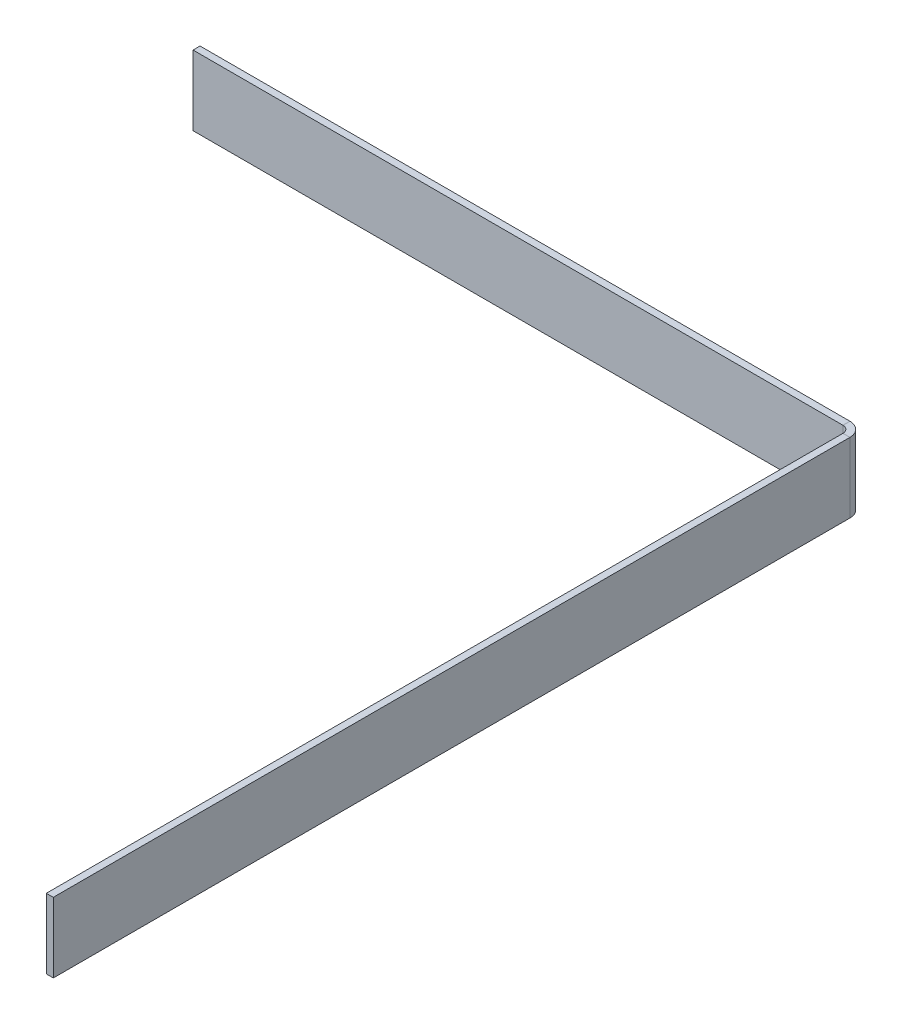
ISO-10303-21;
HEADER;
FILE_DESCRIPTION(('STEP AP214'),'2;1');
FILE_NAME('part.step','',(''),(''),'','','');
FILE_SCHEMA(('AUTOMOTIVE_DESIGN { 1 0 10303 214 1 1 1 1 }'));
ENDSEC;
DATA;
#1=APPLICATION_CONTEXT('core data for automotive mechanical design processes');
#2=APPLICATION_PROTOCOL_DEFINITION('international standard','automotive_design',2000,#1);
#3=PRODUCT_CONTEXT('',#1,'mechanical');
#4=PRODUCT('Part','Part','',(#3));
#5=PRODUCT_RELATED_PRODUCT_CATEGORY('part','',(#4));
#6=PRODUCT_DEFINITION_FORMATION('','',#4);
#7=PRODUCT_DEFINITION_CONTEXT('part definition',#1,'design');
#8=PRODUCT_DEFINITION('design','',#6,#7);
#9=PRODUCT_DEFINITION_SHAPE('','',#8);
#10=(LENGTH_UNIT() NAMED_UNIT(*) SI_UNIT(.MILLI.,.METRE.));
#11=(NAMED_UNIT(*) PLANE_ANGLE_UNIT() SI_UNIT($,.RADIAN.));
#12=(NAMED_UNIT(*) SI_UNIT($,.STERADIAN.) SOLID_ANGLE_UNIT());
#13=UNCERTAINTY_MEASURE_WITH_UNIT(LENGTH_MEASURE(1.E-05),#10,'distance_accuracy_value','');
#14=(GEOMETRIC_REPRESENTATION_CONTEXT(3) GLOBAL_UNCERTAINTY_ASSIGNED_CONTEXT((#13)) GLOBAL_UNIT_ASSIGNED_CONTEXT((#10,
#11,#12)) REPRESENTATION_CONTEXT('',''));
#15=CARTESIAN_POINT('',(0.,0.,0.));
#16=DIRECTION('',(0.,0.,1.));
#17=DIRECTION('',(1.,0.,0.));
#18=AXIS2_PLACEMENT_3D('',#15,#16,#17);
#19=CARTESIAN_POINT('',(0.,20.,2.));
#20=DIRECTION('',(0.,-1.,0.));
#21=DIRECTION('',(-1.,0.,0.));
#22=AXIS2_PLACEMENT_3D('',#19,#20,#21);
#23=PLANE('',#22);
#24=DIRECTION('',(-1.,0.,0.));
#25=VECTOR('',#24,1.);
#26=CARTESIAN_POINT('',(0.,20.,2.));
#27=LINE('',#26,#25);
#28=CARTESIAN_POINT('',(186.,20.,2.00000000000001));
#29=VERTEX_POINT('',#28);
#30=CARTESIAN_POINT('',(0.,20.,2.));
#31=VERTEX_POINT('',#30);
#32=EDGE_CURVE('E85',#29,#31,#27,.T.);
#33=ORIENTED_EDGE('',*,*,#32,.F.);
#34=DIRECTION('',(0.,0.,-1.));
#35=VECTOR('',#34,1.);
#36=CARTESIAN_POINT('',(186.,20.,2.00000000000001));
#37=LINE('',#36,#35);
#38=CARTESIAN_POINT('',(186.,20.,0.));
#39=VERTEX_POINT('',#38);
#40=EDGE_CURVE('E143',#29,#39,#37,.T.);
#41=ORIENTED_EDGE('',*,*,#40,.T.);
#42=DIRECTION('',(-1.,0.,0.));
#43=VECTOR('',#42,1.);
#44=CARTESIAN_POINT('',(0.,20.,0.));
#45=LINE('',#44,#43);
#46=CARTESIAN_POINT('',(0.,20.,0.));
#47=VERTEX_POINT('',#46);
#48=EDGE_CURVE('E186',#39,#47,#45,.T.);
#49=ORIENTED_EDGE('',*,*,#48,.T.);
#50=DIRECTION('',(0.,0.,1.));
#51=VECTOR('',#50,1.);
#52=CARTESIAN_POINT('',(0.,20.,2.));
#53=LINE('',#52,#51);
#54=EDGE_CURVE('E13',#47,#31,#53,.T.);
#55=ORIENTED_EDGE('',*,*,#54,.T.);
#56=EDGE_LOOP('',(#33,#41,#49,#55));
#57=FACE_BOUND('',#56,.T.);
#58=ADVANCED_FACE('F61',(#57),#23,.F.);
#59=CARTESIAN_POINT('',(0.,0.,2.));
#60=DIRECTION('',(0.,0.,-1.));
#61=DIRECTION('',(-1.,0.,0.));
#62=AXIS2_PLACEMENT_3D('',#59,#60,#61);
#63=PLANE('',#62);
#64=DIRECTION('',(0.,1.,0.));
#65=VECTOR('',#64,1.);
#66=CARTESIAN_POINT('',(186.,20.,2.00000000000001));
#67=LINE('',#66,#65);
#68=CARTESIAN_POINT('',(186.,0.,2.00000000000001));
#69=VERTEX_POINT('',#68);
#70=EDGE_CURVE('E144',#29,#69,#67,.F.);
#71=ORIENTED_EDGE('',*,*,#70,.F.);
#72=ORIENTED_EDGE('',*,*,#32,.T.);
#73=DIRECTION('',(0.,-1.,0.));
#74=VECTOR('',#73,1.);
#75=CARTESIAN_POINT('',(0.,0.,2.));
#76=LINE('',#75,#74);
#77=CARTESIAN_POINT('',(0.,0.,2.));
#78=VERTEX_POINT('',#77);
#79=EDGE_CURVE('E183',#31,#78,#76,.T.);
#80=ORIENTED_EDGE('',*,*,#79,.T.);
#81=DIRECTION('',(1.,0.,0.));
#82=VECTOR('',#81,1.);
#83=CARTESIAN_POINT('',(0.,0.,2.));
#84=LINE('',#83,#82);
#85=EDGE_CURVE('E185',#78,#69,#84,.T.);
#86=ORIENTED_EDGE('',*,*,#85,.T.);
#87=EDGE_LOOP('',(#71,#72,#80,#86));
#88=FACE_BOUND('',#87,.T.);
#89=ADVANCED_FACE('F205',(#88),#63,.F.);
#90=CARTESIAN_POINT('',(0.,0.,0.));
#91=DIRECTION('',(0.,0.,-1.));
#92=DIRECTION('',(-1.,0.,0.));
#93=AXIS2_PLACEMENT_3D('',#90,#91,#92);
#94=PLANE('',#93);
#95=ORIENTED_EDGE('',*,*,#48,.F.);
#96=DIRECTION('',(0.,1.,0.));
#97=VECTOR('',#96,1.);
#98=CARTESIAN_POINT('',(186.,20.,0.));
#99=LINE('',#98,#97);
#100=CARTESIAN_POINT('',(186.,0.,0.));
#101=VERTEX_POINT('',#100);
#102=EDGE_CURVE('E103',#39,#101,#99,.F.);
#103=ORIENTED_EDGE('',*,*,#102,.T.);
#104=DIRECTION('',(-1.,0.,0.));
#105=VECTOR('',#104,1.);
#106=CARTESIAN_POINT('',(0.,0.,0.));
#107=LINE('',#106,#105);
#108=CARTESIAN_POINT('',(0.,0.,0.));
#109=VERTEX_POINT('',#108);
#110=EDGE_CURVE('E192',#109,#101,#107,.F.);
#111=ORIENTED_EDGE('',*,*,#110,.F.);
#112=DIRECTION('',(0.,1.,0.));
#113=VECTOR('',#112,1.);
#114=CARTESIAN_POINT('',(0.,0.,0.));
#115=LINE('',#114,#113);
#116=EDGE_CURVE('E181',#47,#109,#115,.F.);
#117=ORIENTED_EDGE('',*,*,#116,.F.);
#118=EDGE_LOOP('',(#95,#103,#111,#117));
#119=FACE_BOUND('',#118,.T.);
#120=ADVANCED_FACE('F198',(#119),#94,.T.);
#121=CARTESIAN_POINT('',(0.,0.,2.));
#122=DIRECTION('',(1.,0.,0.));
#123=DIRECTION('',(0.,-1.,0.));
#124=AXIS2_PLACEMENT_3D('',#121,#122,#123);
#125=PLANE('',#124);
#126=ORIENTED_EDGE('',*,*,#54,.F.);
#127=ORIENTED_EDGE('',*,*,#116,.T.);
#128=DIRECTION('',(0.,0.,1.));
#129=VECTOR('',#128,1.);
#130=CARTESIAN_POINT('',(0.,0.,2.));
#131=LINE('',#130,#129);
#132=EDGE_CURVE('E65',#109,#78,#131,.T.);
#133=ORIENTED_EDGE('',*,*,#132,.T.);
#134=ORIENTED_EDGE('',*,*,#79,.F.);
#135=EDGE_LOOP('',(#126,#127,#133,#134));
#136=FACE_BOUND('',#135,.T.);
#137=ADVANCED_FACE('F201',(#136),#125,.F.);
#138=CARTESIAN_POINT('',(0.,0.,2.));
#139=DIRECTION('',(0.,1.,0.));
#140=DIRECTION('',(1.,0.,0.));
#141=AXIS2_PLACEMENT_3D('',#138,#139,#140);
#142=PLANE('',#141);
#143=DIRECTION('',(0.,0.,-1.));
#144=VECTOR('',#143,1.);
#145=CARTESIAN_POINT('',(186.,0.,2.00000000000001));
#146=LINE('',#145,#144);
#147=EDGE_CURVE('E179',#69,#101,#146,.T.);
#148=ORIENTED_EDGE('',*,*,#147,.F.);
#149=ORIENTED_EDGE('',*,*,#85,.F.);
#150=ORIENTED_EDGE('',*,*,#132,.F.);
#151=ORIENTED_EDGE('',*,*,#110,.T.);
#152=EDGE_LOOP('',(#148,#149,#150,#151));
#153=FACE_BOUND('',#152,.T.);
#154=ADVANCED_FACE('F63',(#153),#142,.F.);
#155=CARTESIAN_POINT('',(186.,0.,4.00000000000001));
#156=DIRECTION('',(0.,-1.,0.));
#157=DIRECTION('',(0.,0.,-1.));
#158=AXIS2_PLACEMENT_3D('',#155,#156,#157);
#159=PLANE('',#158);
#160=DIRECTION('',(-1.,0.,0.));
#161=VECTOR('',#160,1.);
#162=CARTESIAN_POINT('',(190.,0.,4.));
#163=LINE('',#162,#161);
#164=CARTESIAN_POINT('',(188.,0.,4.));
#165=VERTEX_POINT('',#164);
#166=CARTESIAN_POINT('',(190.,0.,4.));
#167=VERTEX_POINT('',#166);
#168=EDGE_CURVE('E134',#165,#167,#163,.F.);
#169=ORIENTED_EDGE('',*,*,#168,.F.);
#170=CARTESIAN_POINT('',(186.,0.,4.00000000000001));
#171=DIRECTION('',(0.,1.,0.));
#172=DIRECTION('',(0.,0.,1.));
#173=AXIS2_PLACEMENT_3D('',#170,#171,#172);
#174=CIRCLE('',#173,2.);
#175=EDGE_CURVE('E128',#69,#165,#174,.F.);
#176=ORIENTED_EDGE('',*,*,#175,.F.);
#177=ORIENTED_EDGE('',*,*,#147,.T.);
#178=CARTESIAN_POINT('',(186.,0.,4.00000000000001));
#179=DIRECTION('',(0.,1.,0.));
#180=DIRECTION('',(0.,0.,1.));
#181=AXIS2_PLACEMENT_3D('',#178,#179,#180);
#182=CIRCLE('',#181,4.);
#183=EDGE_CURVE('E76',#101,#167,#182,.F.);
#184=ORIENTED_EDGE('',*,*,#183,.T.);
#185=EDGE_LOOP('',(#169,#176,#177,#184));
#186=FACE_BOUND('',#185,.T.);
#187=ADVANCED_FACE('F218',(#186),#159,.T.);
#188=CARTESIAN_POINT('',(186.,20.,4.00000000000001));
#189=DIRECTION('',(0.,-1.,0.));
#190=DIRECTION('',(0.,0.,-1.));
#191=AXIS2_PLACEMENT_3D('',#188,#189,#190);
#192=PLANE('',#191);
#193=CARTESIAN_POINT('',(186.,20.,4.00000000000001));
#194=DIRECTION('',(0.,1.,0.));
#195=DIRECTION('',(0.,0.,1.));
#196=AXIS2_PLACEMENT_3D('',#193,#194,#195);
#197=CIRCLE('',#196,2.);
#198=CARTESIAN_POINT('',(188.,20.,4.));
#199=VERTEX_POINT('',#198);
#200=EDGE_CURVE('E126',#199,#29,#197,.T.);
#201=ORIENTED_EDGE('',*,*,#200,.F.);
#202=DIRECTION('',(-1.,0.,0.));
#203=VECTOR('',#202,1.);
#204=CARTESIAN_POINT('',(188.,20.,4.));
#205=LINE('',#204,#203);
#206=CARTESIAN_POINT('',(190.,20.,4.));
#207=VERTEX_POINT('',#206);
#208=EDGE_CURVE('E133',#199,#207,#205,.F.);
#209=ORIENTED_EDGE('',*,*,#208,.T.);
#210=CARTESIAN_POINT('',(186.,20.,4.00000000000001));
#211=DIRECTION('',(0.,1.,0.));
#212=DIRECTION('',(0.,0.,1.));
#213=AXIS2_PLACEMENT_3D('',#210,#211,#212);
#214=CIRCLE('',#213,4.);
#215=EDGE_CURVE('E174',#207,#39,#214,.T.);
#216=ORIENTED_EDGE('',*,*,#215,.T.);
#217=ORIENTED_EDGE('',*,*,#40,.F.);
#218=EDGE_LOOP('',(#201,#209,#216,#217));
#219=FACE_BOUND('',#218,.T.);
#220=ADVANCED_FACE('F139',(#219),#192,.F.);
#221=CARTESIAN_POINT('',(186.,20.,4.00000000000001));
#222=DIRECTION('',(0.,1.,0.));
#223=DIRECTION('',(1.,0.,0.));
#224=AXIS2_PLACEMENT_3D('',#221,#222,#223);
#225=CYLINDRICAL_SURFACE('',#224,4.);
#226=ORIENTED_EDGE('',*,*,#102,.F.);
#227=ORIENTED_EDGE('',*,*,#215,.F.);
#228=DIRECTION('',(0.,1.,0.));
#229=VECTOR('',#228,1.);
#230=CARTESIAN_POINT('',(190.,0.,4.));
#231=LINE('',#230,#229);
#232=EDGE_CURVE('E157',#207,#167,#231,.F.);
#233=ORIENTED_EDGE('',*,*,#232,.T.);
#234=ORIENTED_EDGE('',*,*,#183,.F.);
#235=EDGE_LOOP('',(#226,#227,#233,#234));
#236=FACE_BOUND('',#235,.T.);
#237=ADVANCED_FACE('F217',(#236),#225,.T.);
#238=CARTESIAN_POINT('',(186.,20.,4.00000000000001));
#239=DIRECTION('',(0.,1.,0.));
#240=DIRECTION('',(1.,0.,0.));
#241=AXIS2_PLACEMENT_3D('',#238,#239,#240);
#242=CYLINDRICAL_SURFACE('',#241,2.);
#243=ORIENTED_EDGE('',*,*,#70,.T.);
#244=ORIENTED_EDGE('',*,*,#175,.T.);
#245=DIRECTION('',(0.,1.,0.));
#246=VECTOR('',#245,1.);
#247=CARTESIAN_POINT('',(188.,0.,4.));
#248=LINE('',#247,#246);
#249=EDGE_CURVE('E123',#165,#199,#248,.T.);
#250=ORIENTED_EDGE('',*,*,#249,.T.);
#251=ORIENTED_EDGE('',*,*,#200,.T.);
#252=EDGE_LOOP('',(#243,#244,#250,#251));
#253=FACE_BOUND('',#252,.T.);
#254=ADVANCED_FACE('F125',(#253),#242,.F.);
#255=CARTESIAN_POINT('',(190.,0.,1.99999999999999));
#256=DIRECTION('',(0.,1.,0.));
#257=DIRECTION('',(0.,0.,1.));
#258=AXIS2_PLACEMENT_3D('',#255,#256,#257);
#259=PLANE('',#258);
#260=ORIENTED_EDGE('',*,*,#168,.T.);
#261=DIRECTION('',(0.,0.,-1.));
#262=VECTOR('',#261,1.);
#263=CARTESIAN_POINT('',(190.,0.,-6.71910013295579E-13));
#264=LINE('',#263,#262);
#265=CARTESIAN_POINT('',(190.000000000001,0.,232.));
#266=VERTEX_POINT('',#265);
#267=EDGE_CURVE('E165',#266,#167,#264,.T.);
#268=ORIENTED_EDGE('',*,*,#267,.F.);
#269=DIRECTION('',(-1.,0.,0.));
#270=VECTOR('',#269,1.);
#271=CARTESIAN_POINT('',(190.000000000001,0.,232.));
#272=LINE('',#271,#270);
#273=CARTESIAN_POINT('',(188.000000000001,0.,232.));
#274=VERTEX_POINT('',#273);
#275=EDGE_CURVE('E250',#266,#274,#272,.T.);
#276=ORIENTED_EDGE('',*,*,#275,.T.);
#277=DIRECTION('',(0.,0.,1.));
#278=VECTOR('',#277,1.);
#279=CARTESIAN_POINT('',(188.,0.,2.));
#280=LINE('',#279,#278);
#281=EDGE_CURVE('E163',#274,#165,#280,.F.);
#282=ORIENTED_EDGE('',*,*,#281,.T.);
#283=EDGE_LOOP('',(#260,#268,#276,#282));
#284=FACE_BOUND('',#283,.T.);
#285=ADVANCED_FACE('F224',(#284),#259,.F.);
#286=CARTESIAN_POINT('',(190.000000000001,20.,232.));
#287=DIRECTION('',(0.,-1.,0.));
#288=DIRECTION('',(0.,0.,-1.));
#289=AXIS2_PLACEMENT_3D('',#286,#287,#288);
#290=PLANE('',#289);
#291=ORIENTED_EDGE('',*,*,#208,.F.);
#292=DIRECTION('',(0.,0.,-1.));
#293=VECTOR('',#292,1.);
#294=CARTESIAN_POINT('',(188.000000000001,20.,232.));
#295=LINE('',#294,#293);
#296=CARTESIAN_POINT('',(188.000000000001,20.,232.));
#297=VERTEX_POINT('',#296);
#298=EDGE_CURVE('E153',#199,#297,#295,.F.);
#299=ORIENTED_EDGE('',*,*,#298,.T.);
#300=DIRECTION('',(-1.,0.,0.));
#301=VECTOR('',#300,1.);
#302=CARTESIAN_POINT('',(190.000000000001,20.,232.));
#303=LINE('',#302,#301);
#304=CARTESIAN_POINT('',(190.000000000001,20.,232.));
#305=VERTEX_POINT('',#304);
#306=EDGE_CURVE('E145',#305,#297,#303,.T.);
#307=ORIENTED_EDGE('',*,*,#306,.F.);
#308=DIRECTION('',(0.,0.,1.));
#309=VECTOR('',#308,1.);
#310=CARTESIAN_POINT('',(190.,20.,-6.69798176020477E-13));
#311=LINE('',#310,#309);
#312=EDGE_CURVE('E156',#207,#305,#311,.T.);
#313=ORIENTED_EDGE('',*,*,#312,.F.);
#314=EDGE_LOOP('',(#291,#299,#307,#313));
#315=FACE_BOUND('',#314,.T.);
#316=ADVANCED_FACE('F150',(#315),#290,.F.);
#317=CARTESIAN_POINT('',(190.,0.,-6.71910013295579E-13));
#318=DIRECTION('',(-1.,0.,0.));
#319=DIRECTION('',(0.,0.,1.));
#320=AXIS2_PLACEMENT_3D('',#317,#318,#319);
#321=PLANE('',#320);
#322=ORIENTED_EDGE('',*,*,#232,.F.);
#323=ORIENTED_EDGE('',*,*,#312,.T.);
#324=DIRECTION('',(0.,-1.,0.));
#325=VECTOR('',#324,1.);
#326=CARTESIAN_POINT('',(190.000000000001,0.,232.));
#327=LINE('',#326,#325);
#328=EDGE_CURVE('E256',#305,#266,#327,.T.);
#329=ORIENTED_EDGE('',*,*,#328,.T.);
#330=ORIENTED_EDGE('',*,*,#267,.T.);
#331=EDGE_LOOP('',(#322,#323,#329,#330));
#332=FACE_BOUND('',#331,.T.);
#333=ADVANCED_FACE('F232',(#332),#321,.F.);
#334=CARTESIAN_POINT('',(188.,0.,-6.64927050617892E-13));
#335=DIRECTION('',(-1.,0.,0.));
#336=DIRECTION('',(0.,0.,1.));
#337=AXIS2_PLACEMENT_3D('',#334,#335,#336);
#338=PLANE('',#337);
#339=ORIENTED_EDGE('',*,*,#298,.F.);
#340=ORIENTED_EDGE('',*,*,#249,.F.);
#341=ORIENTED_EDGE('',*,*,#281,.F.);
#342=DIRECTION('',(0.,1.,0.));
#343=VECTOR('',#342,1.);
#344=CARTESIAN_POINT('',(188.000000000001,0.,232.));
#345=LINE('',#344,#343);
#346=EDGE_CURVE('E162',#297,#274,#345,.F.);
#347=ORIENTED_EDGE('',*,*,#346,.F.);
#348=EDGE_LOOP('',(#339,#340,#341,#347));
#349=FACE_BOUND('',#348,.T.);
#350=ADVANCED_FACE('F160',(#349),#338,.T.);
#351=CARTESIAN_POINT('',(190.000000000001,0.,232.));
#352=DIRECTION('',(0.,0.,-1.));
#353=DIRECTION('',(-1.,0.,0.));
#354=AXIS2_PLACEMENT_3D('',#351,#352,#353);
#355=PLANE('',#354);
#356=ORIENTED_EDGE('',*,*,#346,.T.);
#357=ORIENTED_EDGE('',*,*,#275,.F.);
#358=ORIENTED_EDGE('',*,*,#328,.F.);
#359=ORIENTED_EDGE('',*,*,#306,.T.);
#360=EDGE_LOOP('',(#356,#357,#358,#359));
#361=FACE_BOUND('',#360,.T.);
#362=ADVANCED_FACE('F233',(#361),#355,.F.);
#363=CLOSED_SHELL('',(#58,#89,#120,#137,#154,#187,#220,#237,#254,#285,#316,#333,#350,#362));
#364=MANIFOLD_SOLID_BREP('B2',#363);
#365=ADVANCED_BREP_SHAPE_REPRESENTATION('',(#18,#364),#14);
#366=SHAPE_DEFINITION_REPRESENTATION(#9,#365);
ENDSEC;
END-ISO-10303-21;
